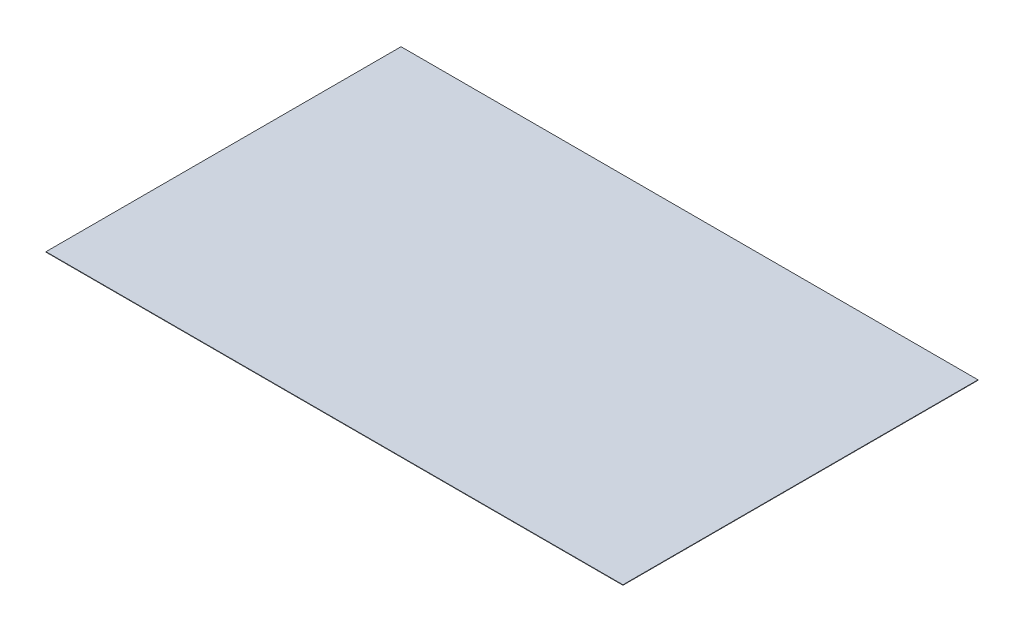
ISO-10303-21;
HEADER;
FILE_DESCRIPTION(('STEP AP214'),'2;1');
FILE_NAME('part.step','',(''),(''),'','','');
FILE_SCHEMA(('AUTOMOTIVE_DESIGN { 1 0 10303 214 1 1 1 1 }'));
ENDSEC;
DATA;
#1=APPLICATION_CONTEXT('core data for automotive mechanical design processes');
#2=APPLICATION_PROTOCOL_DEFINITION('international standard','automotive_design',2000,#1);
#3=PRODUCT_CONTEXT('',#1,'mechanical');
#4=PRODUCT('Part','Part','',(#3));
#5=PRODUCT_RELATED_PRODUCT_CATEGORY('part','',(#4));
#6=PRODUCT_DEFINITION_FORMATION('','',#4);
#7=PRODUCT_DEFINITION_CONTEXT('part definition',#1,'design');
#8=PRODUCT_DEFINITION('design','',#6,#7);
#9=PRODUCT_DEFINITION_SHAPE('','',#8);
#10=(LENGTH_UNIT() NAMED_UNIT(*) SI_UNIT(.MILLI.,.METRE.));
#11=(NAMED_UNIT(*) PLANE_ANGLE_UNIT() SI_UNIT($,.RADIAN.));
#12=(NAMED_UNIT(*) SI_UNIT($,.STERADIAN.) SOLID_ANGLE_UNIT());
#13=UNCERTAINTY_MEASURE_WITH_UNIT(LENGTH_MEASURE(1.E-05),#10,'distance_accuracy_value','');
#14=(GEOMETRIC_REPRESENTATION_CONTEXT(3) GLOBAL_UNCERTAINTY_ASSIGNED_CONTEXT((#13)) GLOBAL_UNIT_ASSIGNED_CONTEXT((#10,
#11,#12)) REPRESENTATION_CONTEXT('',''));
#15=CARTESIAN_POINT('',(0.,0.,0.));
#16=DIRECTION('',(0.,0.,1.));
#17=DIRECTION('',(1.,0.,0.));
#18=AXIS2_PLACEMENT_3D('',#15,#16,#17);
#19=CARTESIAN_POINT('',(6500.,10.,-4000.));
#20=DIRECTION('',(-1.,0.,0.));
#21=DIRECTION('',(0.,0.,1.));
#22=AXIS2_PLACEMENT_3D('',#19,#20,#21);
#23=PLANE('',#22);
#24=DIRECTION('',(0.,0.,-1.));
#25=VECTOR('',#24,1.);
#26=CARTESIAN_POINT('',(6500.,0.,-4000.));
#27=LINE('',#26,#25);
#28=CARTESIAN_POINT('',(6500.,0.,4000.));
#29=VERTEX_POINT('',#28);
#30=CARTESIAN_POINT('',(6500.,0.,-4000.));
#31=VERTEX_POINT('',#30);
#32=EDGE_CURVE('E97',#29,#31,#27,.T.);
#33=ORIENTED_EDGE('',*,*,#32,.T.);
#34=DIRECTION('',(0.,-1.,0.));
#35=VECTOR('',#34,1.);
#36=CARTESIAN_POINT('',(6500.,10.,-4000.));
#37=LINE('',#36,#35);
#38=CARTESIAN_POINT('',(6500.,10.,-4000.));
#39=VERTEX_POINT('',#38);
#40=EDGE_CURVE('E11',#39,#31,#37,.T.);
#41=ORIENTED_EDGE('',*,*,#40,.F.);
#42=DIRECTION('',(0.,0.,-1.));
#43=VECTOR('',#42,1.);
#44=CARTESIAN_POINT('',(6500.,10.,-4000.));
#45=LINE('',#44,#43);
#46=CARTESIAN_POINT('',(6500.,10.,4000.));
#47=VERTEX_POINT('',#46);
#48=EDGE_CURVE('E85',#47,#39,#45,.T.);
#49=ORIENTED_EDGE('',*,*,#48,.F.);
#50=DIRECTION('',(0.,-1.,0.));
#51=VECTOR('',#50,1.);
#52=CARTESIAN_POINT('',(6500.,10.,4000.));
#53=LINE('',#52,#51);
#54=EDGE_CURVE('E93',#47,#29,#53,.T.);
#55=ORIENTED_EDGE('',*,*,#54,.T.);
#56=EDGE_LOOP('',(#33,#41,#49,#55));
#57=FACE_BOUND('',#56,.T.);
#58=ADVANCED_FACE('F34',(#57),#23,.F.);
#59=CARTESIAN_POINT('',(-6500.,10.,-4000.));
#60=DIRECTION('',(0.,0.,1.));
#61=DIRECTION('',(1.,0.,0.));
#62=AXIS2_PLACEMENT_3D('',#59,#60,#61);
#63=PLANE('',#62);
#64=DIRECTION('',(-1.,0.,0.));
#65=VECTOR('',#64,1.);
#66=CARTESIAN_POINT('',(-6500.,0.,-4000.));
#67=LINE('',#66,#65);
#68=CARTESIAN_POINT('',(-6500.,0.,-4000.));
#69=VERTEX_POINT('',#68);
#70=EDGE_CURVE('E89',#31,#69,#67,.T.);
#71=ORIENTED_EDGE('',*,*,#70,.T.);
#72=DIRECTION('',(0.,-1.,0.));
#73=VECTOR('',#72,1.);
#74=CARTESIAN_POINT('',(-6500.,10.,-4000.));
#75=LINE('',#74,#73);
#76=CARTESIAN_POINT('',(-6500.,10.,-4000.));
#77=VERTEX_POINT('',#76);
#78=EDGE_CURVE('E42',#77,#69,#75,.T.);
#79=ORIENTED_EDGE('',*,*,#78,.F.);
#80=DIRECTION('',(-1.,0.,0.));
#81=VECTOR('',#80,1.);
#82=CARTESIAN_POINT('',(-6500.,10.,-4000.));
#83=LINE('',#82,#81);
#84=EDGE_CURVE('E80',#39,#77,#83,.T.);
#85=ORIENTED_EDGE('',*,*,#84,.F.);
#86=ORIENTED_EDGE('',*,*,#40,.T.);
#87=EDGE_LOOP('',(#71,#79,#85,#86));
#88=FACE_BOUND('',#87,.T.);
#89=ADVANCED_FACE('F88',(#88),#63,.F.);
#90=CARTESIAN_POINT('',(-6500.,10.,-4000.));
#91=DIRECTION('',(1.,0.,0.));
#92=DIRECTION('',(0.,0.,-1.));
#93=AXIS2_PLACEMENT_3D('',#90,#91,#92);
#94=PLANE('',#93);
#95=DIRECTION('',(0.,0.,1.));
#96=VECTOR('',#95,1.);
#97=CARTESIAN_POINT('',(-6500.,0.,-4000.));
#98=LINE('',#97,#96);
#99=CARTESIAN_POINT('',(-6500.,0.,4000.));
#100=VERTEX_POINT('',#99);
#101=EDGE_CURVE('E67',#69,#100,#98,.T.);
#102=ORIENTED_EDGE('',*,*,#101,.T.);
#103=DIRECTION('',(0.,-1.,0.));
#104=VECTOR('',#103,1.);
#105=CARTESIAN_POINT('',(-6500.,10.,4000.));
#106=LINE('',#105,#104);
#107=CARTESIAN_POINT('',(-6500.,10.,4000.));
#108=VERTEX_POINT('',#107);
#109=EDGE_CURVE('E90',#108,#100,#106,.T.);
#110=ORIENTED_EDGE('',*,*,#109,.F.);
#111=DIRECTION('',(0.,0.,1.));
#112=VECTOR('',#111,1.);
#113=CARTESIAN_POINT('',(-6500.,10.,-4000.));
#114=LINE('',#113,#112);
#115=EDGE_CURVE('E83',#77,#108,#114,.T.);
#116=ORIENTED_EDGE('',*,*,#115,.F.);
#117=ORIENTED_EDGE('',*,*,#78,.T.);
#118=EDGE_LOOP('',(#102,#110,#116,#117));
#119=FACE_BOUND('',#118,.T.);
#120=ADVANCED_FACE('F91',(#119),#94,.F.);
#121=CARTESIAN_POINT('',(-6500.,10.,4000.));
#122=DIRECTION('',(0.,0.,-1.));
#123=DIRECTION('',(-1.,0.,0.));
#124=AXIS2_PLACEMENT_3D('',#121,#122,#123);
#125=PLANE('',#124);
#126=DIRECTION('',(1.,0.,0.));
#127=VECTOR('',#126,1.);
#128=CARTESIAN_POINT('',(-6500.,0.,4000.));
#129=LINE('',#128,#127);
#130=EDGE_CURVE('E73',#100,#29,#129,.T.);
#131=ORIENTED_EDGE('',*,*,#130,.T.);
#132=ORIENTED_EDGE('',*,*,#54,.F.);
#133=DIRECTION('',(1.,0.,0.));
#134=VECTOR('',#133,1.);
#135=CARTESIAN_POINT('',(-6500.,10.,4000.));
#136=LINE('',#135,#134);
#137=EDGE_CURVE('E50',#108,#47,#136,.T.);
#138=ORIENTED_EDGE('',*,*,#137,.F.);
#139=ORIENTED_EDGE('',*,*,#109,.T.);
#140=EDGE_LOOP('',(#131,#132,#138,#139));
#141=FACE_BOUND('',#140,.T.);
#142=ADVANCED_FACE('F104',(#141),#125,.F.);
#143=CARTESIAN_POINT('',(0.,10.,0.));
#144=DIRECTION('',(0.,1.,0.));
#145=DIRECTION('',(0.,0.,1.));
#146=AXIS2_PLACEMENT_3D('',#143,#144,#145);
#147=PLANE('',#146);
#148=ORIENTED_EDGE('',*,*,#48,.T.);
#149=ORIENTED_EDGE('',*,*,#84,.T.);
#150=ORIENTED_EDGE('',*,*,#115,.T.);
#151=ORIENTED_EDGE('',*,*,#137,.T.);
#152=EDGE_LOOP('',(#148,#149,#150,#151));
#153=FACE_BOUND('',#152,.T.);
#154=ADVANCED_FACE('F81',(#153),#147,.T.);
#155=CARTESIAN_POINT('',(0.,0.,0.));
#156=DIRECTION('',(0.,1.,0.));
#157=DIRECTION('',(0.,0.,1.));
#158=AXIS2_PLACEMENT_3D('',#155,#156,#157);
#159=PLANE('',#158);
#160=ORIENTED_EDGE('',*,*,#32,.F.);
#161=ORIENTED_EDGE('',*,*,#130,.F.);
#162=ORIENTED_EDGE('',*,*,#101,.F.);
#163=ORIENTED_EDGE('',*,*,#70,.F.);
#164=EDGE_LOOP('',(#160,#161,#162,#163));
#165=FACE_BOUND('',#164,.T.);
#166=ADVANCED_FACE('F107',(#165),#159,.F.);
#167=CLOSED_SHELL('',(#58,#89,#120,#142,#154,#166));
#168=MANIFOLD_SOLID_BREP('B2',#167);
#169=ADVANCED_BREP_SHAPE_REPRESENTATION('',(#18,#168),#14);
#170=SHAPE_DEFINITION_REPRESENTATION(#9,#169);
ENDSEC;
END-ISO-10303-21;
